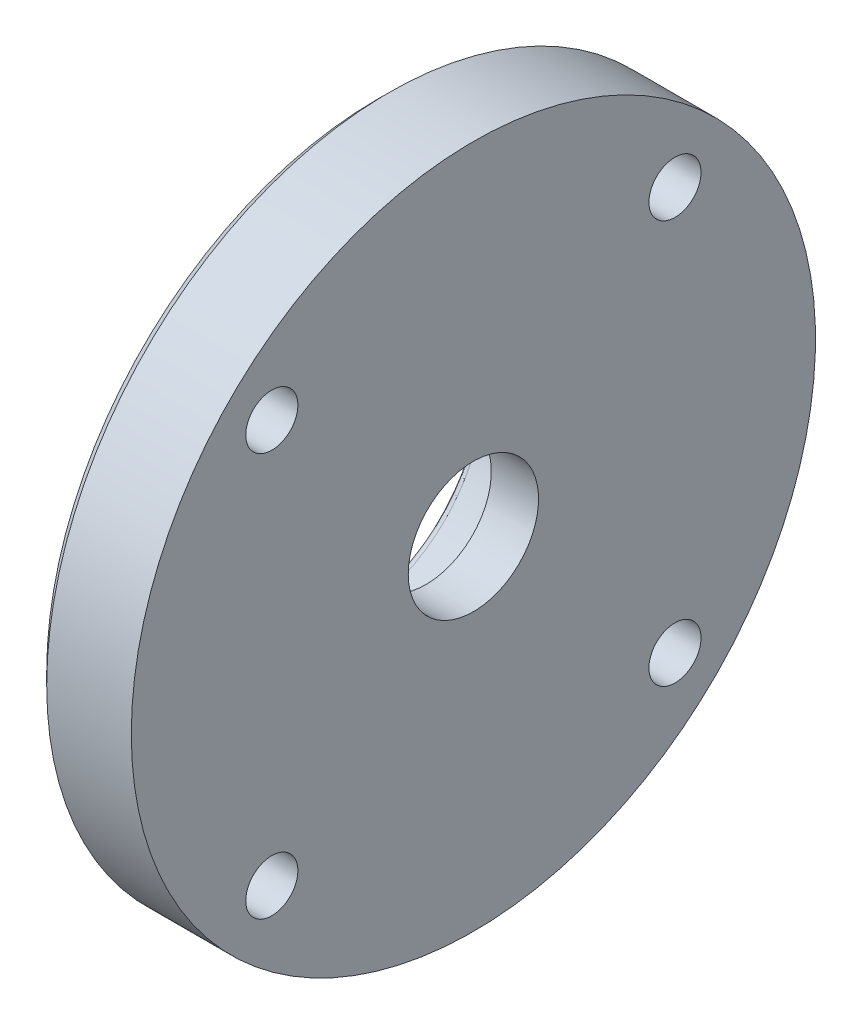
ISO-10303-21;
HEADER;
FILE_DESCRIPTION(('STEP AP214'),'2;1');
FILE_NAME('part.step','',(''),(''),'','','');
FILE_SCHEMA(('AUTOMOTIVE_DESIGN { 1 0 10303 214 1 1 1 1 }'));
ENDSEC;
DATA;
#1=APPLICATION_CONTEXT('core data for automotive mechanical design processes');
#2=APPLICATION_PROTOCOL_DEFINITION('international standard','automotive_design',2000,#1);
#3=PRODUCT_CONTEXT('',#1,'mechanical');
#4=PRODUCT('Part','Part','',(#3));
#5=PRODUCT_RELATED_PRODUCT_CATEGORY('part','',(#4));
#6=PRODUCT_DEFINITION_FORMATION('','',#4);
#7=PRODUCT_DEFINITION_CONTEXT('part definition',#1,'design');
#8=PRODUCT_DEFINITION('design','',#6,#7);
#9=PRODUCT_DEFINITION_SHAPE('','',#8);
#10=(LENGTH_UNIT() NAMED_UNIT(*) SI_UNIT(.MILLI.,.METRE.));
#11=(NAMED_UNIT(*) PLANE_ANGLE_UNIT() SI_UNIT($,.RADIAN.));
#12=(NAMED_UNIT(*) SI_UNIT($,.STERADIAN.) SOLID_ANGLE_UNIT());
#13=UNCERTAINTY_MEASURE_WITH_UNIT(LENGTH_MEASURE(1.E-05),#10,'distance_accuracy_value','');
#14=(GEOMETRIC_REPRESENTATION_CONTEXT(3) GLOBAL_UNCERTAINTY_ASSIGNED_CONTEXT((#13)) GLOBAL_UNIT_ASSIGNED_CONTEXT((#10,
#11,#12)) REPRESENTATION_CONTEXT('',''));
#15=CARTESIAN_POINT('',(0.,0.,0.));
#16=DIRECTION('',(0.,0.,1.));
#17=DIRECTION('',(1.,0.,0.));
#18=AXIS2_PLACEMENT_3D('',#15,#16,#17);
#19=CARTESIAN_POINT('',(10.,0.,0.));
#20=DIRECTION('',(-1.,0.,0.));
#21=DIRECTION('',(0.,0.,1.));
#22=AXIS2_PLACEMENT_3D('',#19,#20,#21);
#23=CYLINDRICAL_SURFACE('',#22,4.);
#24=CARTESIAN_POINT('',(5.9,0.,0.));
#25=DIRECTION('',(-1.,0.,0.));
#26=DIRECTION('',(0.,0.,1.));
#27=AXIS2_PLACEMENT_3D('',#24,#25,#26);
#28=CIRCLE('',#27,4.);
#29=CARTESIAN_POINT('',(5.9,0.,4.));
#30=VERTEX_POINT('',#29);
#31=EDGE_CURVE('E238',#30,#30,#28,.T.);
#32=ORIENTED_EDGE('',*,*,#31,.F.);
#33=EDGE_LOOP('',(#32));
#34=FACE_BOUND('',#33,.T.);
#35=CARTESIAN_POINT('',(3.,0.,0.));
#36=DIRECTION('',(-1.,0.,0.));
#37=DIRECTION('',(0.,0.,1.));
#38=AXIS2_PLACEMENT_3D('',#35,#36,#37);
#39=CIRCLE('',#38,4.);
#40=CARTESIAN_POINT('',(3.,0.,4.));
#41=VERTEX_POINT('',#40);
#42=EDGE_CURVE('E38',#41,#41,#39,.F.);
#43=ORIENTED_EDGE('',*,*,#42,.F.);
#44=EDGE_LOOP('',(#43));
#45=FACE_BOUND('',#44,.T.);
#46=ADVANCED_FACE('F34',(#34,#45),#23,.F.);
#47=CARTESIAN_POINT('',(0.,0.,0.));
#48=DIRECTION('',(1.,0.,0.));
#49=DIRECTION('',(0.,0.,-1.));
#50=AXIS2_PLACEMENT_3D('',#47,#48,#49);
#51=PLANE('',#50);
#52=CARTESIAN_POINT('',(0.,-12.3743686707646,12.3743686707656));
#53=DIRECTION('',(-1.,0.,0.));
#54=DIRECTION('',(0.,0.,1.));
#55=AXIS2_PLACEMENT_3D('',#52,#53,#54);
#56=CIRCLE('',#55,1.59999999999961);
#57=CARTESIAN_POINT('',(0.,-12.3743686707646,13.9743686707652));
#58=VERTEX_POINT('',#57);
#59=EDGE_CURVE('E232',#58,#58,#56,.T.);
#60=ORIENTED_EDGE('',*,*,#59,.F.);
#61=EDGE_LOOP('',(#60));
#62=FACE_BOUND('',#61,.T.);
#63=CARTESIAN_POINT('',(0.,-12.3743686707656,-12.3743686707635));
#64=DIRECTION('',(-1.,0.,0.));
#65=DIRECTION('',(0.,0.,1.));
#66=AXIS2_PLACEMENT_3D('',#63,#64,#65);
#67=CIRCLE('',#66,1.60000000000063);
#68=CARTESIAN_POINT('',(0.,-12.3743686707656,-10.7743686707629));
#69=VERTEX_POINT('',#68);
#70=EDGE_CURVE('E229',#69,#69,#67,.T.);
#71=ORIENTED_EDGE('',*,*,#70,.F.);
#72=EDGE_LOOP('',(#71));
#73=FACE_BOUND('',#72,.T.);
#74=CARTESIAN_POINT('',(0.,12.3743686707635,-12.3743686707646));
#75=DIRECTION('',(-1.,0.,0.));
#76=DIRECTION('',(0.,0.,1.));
#77=AXIS2_PLACEMENT_3D('',#74,#75,#76);
#78=CIRCLE('',#77,1.60000000000097);
#79=CARTESIAN_POINT('',(0.,12.3743686707635,-10.7743686707636));
#80=VERTEX_POINT('',#79);
#81=EDGE_CURVE('E226',#80,#80,#78,.T.);
#82=ORIENTED_EDGE('',*,*,#81,.F.);
#83=EDGE_LOOP('',(#82));
#84=FACE_BOUND('',#83,.T.);
#85=CARTESIAN_POINT('',(0.,12.3743686707646,12.3743686707646));
#86=DIRECTION('',(-1.,0.,0.));
#87=DIRECTION('',(0.,0.,1.));
#88=AXIS2_PLACEMENT_3D('',#85,#86,#87);
#89=CIRCLE('',#88,1.6);
#90=CARTESIAN_POINT('',(0.,12.3743686707646,13.9743686707646));
#91=VERTEX_POINT('',#90);
#92=EDGE_CURVE('E222',#91,#91,#89,.T.);
#93=ORIENTED_EDGE('',*,*,#92,.F.);
#94=EDGE_LOOP('',(#93));
#95=FACE_BOUND('',#94,.T.);
#96=CARTESIAN_POINT('',(0.,-4.79583152331272,11.));
#97=DIRECTION('',(1.,0.,0.));
#98=DIRECTION('',(0.,0.,-1.));
#99=AXIS2_PLACEMENT_3D('',#96,#97,#98);
#100=CIRCLE('',#99,1.);
#101=CARTESIAN_POINT('',(0.,-5.19548415025544,11.9166666666667));
#102=VERTEX_POINT('',#101);
#103=CARTESIAN_POINT('',(0.,-4.79583152331272,12.));
#104=VERTEX_POINT('',#103);
#105=EDGE_CURVE('E272',#102,#104,#100,.F.);
#106=ORIENTED_EDGE('',*,*,#105,.F.);
#107=CARTESIAN_POINT('',(0.,0.,0.));
#108=DIRECTION('',(1.,0.,0.));
#109=DIRECTION('',(0.,0.,-1.));
#110=AXIS2_PLACEMENT_3D('',#107,#108,#109);
#111=CIRCLE('',#110,13.);
#112=CARTESIAN_POINT('',(0.,-5.19548415025545,-11.9166666666667));
#113=VERTEX_POINT('',#112);
#114=EDGE_CURVE('E278',#102,#113,#111,.T.);
#115=ORIENTED_EDGE('',*,*,#114,.T.);
#116=CARTESIAN_POINT('',(0.,-4.79583152331272,-11.));
#117=DIRECTION('',(1.,0.,0.));
#118=DIRECTION('',(0.,0.,-1.));
#119=AXIS2_PLACEMENT_3D('',#116,#117,#118);
#120=CIRCLE('',#119,1.);
#121=CARTESIAN_POINT('',(0.,-4.79583152331272,-12.));
#122=VERTEX_POINT('',#121);
#123=EDGE_CURVE('E275',#122,#113,#120,.F.);
#124=ORIENTED_EDGE('',*,*,#123,.F.);
#125=DIRECTION('',(0.,-1.,0.));
#126=VECTOR('',#125,1.);
#127=CARTESIAN_POINT('',(0.,4.89897948556635,-12.));
#128=LINE('',#127,#126);
#129=CARTESIAN_POINT('',(0.,4.79583152331272,-12.));
#130=VERTEX_POINT('',#129);
#131=EDGE_CURVE('E269',#122,#130,#128,.F.);
#132=ORIENTED_EDGE('',*,*,#131,.T.);
#133=CARTESIAN_POINT('',(0.,4.79583152331272,-11.));
#134=DIRECTION('',(1.,0.,0.));
#135=DIRECTION('',(0.,0.,-1.));
#136=AXIS2_PLACEMENT_3D('',#133,#134,#135);
#137=CIRCLE('',#136,1.);
#138=CARTESIAN_POINT('',(0.,5.19548415025545,-11.9166666666667));
#139=VERTEX_POINT('',#138);
#140=EDGE_CURVE('E266',#139,#130,#137,.F.);
#141=ORIENTED_EDGE('',*,*,#140,.F.);
#142=CARTESIAN_POINT('',(0.,0.,0.));
#143=DIRECTION('',(1.,0.,0.));
#144=DIRECTION('',(0.,0.,-1.));
#145=AXIS2_PLACEMENT_3D('',#142,#143,#144);
#146=CIRCLE('',#145,13.);
#147=CARTESIAN_POINT('',(0.,5.19548415025545,11.9166666666667));
#148=VERTEX_POINT('',#147);
#149=EDGE_CURVE('E262',#139,#148,#146,.T.);
#150=ORIENTED_EDGE('',*,*,#149,.T.);
#151=CARTESIAN_POINT('',(0.,4.79583152331272,11.));
#152=DIRECTION('',(1.,0.,0.));
#153=DIRECTION('',(0.,0.,-1.));
#154=AXIS2_PLACEMENT_3D('',#151,#152,#153);
#155=CIRCLE('',#154,1.);
#156=CARTESIAN_POINT('',(0.,4.79583152331272,12.));
#157=VERTEX_POINT('',#156);
#158=EDGE_CURVE('E259',#157,#148,#155,.F.);
#159=ORIENTED_EDGE('',*,*,#158,.F.);
#160=DIRECTION('',(0.,1.,0.));
#161=VECTOR('',#160,1.);
#162=CARTESIAN_POINT('',(0.,-4.89897948556635,12.));
#163=LINE('',#162,#161);
#164=EDGE_CURVE('E264',#157,#104,#163,.F.);
#165=ORIENTED_EDGE('',*,*,#164,.T.);
#166=EDGE_LOOP('',(#106,#115,#124,#132,#141,#150,#159,#165));
#167=FACE_BOUND('',#166,.T.);
#168=CARTESIAN_POINT('',(0.,0.,0.));
#169=DIRECTION('',(-1.,0.,0.));
#170=DIRECTION('',(0.,0.,1.));
#171=AXIS2_PLACEMENT_3D('',#168,#169,#170);
#172=CIRCLE('',#171,20.2928932188135);
#173=CARTESIAN_POINT('',(0.,0.,20.2928932188135));
#174=VERTEX_POINT('',#173);
#175=EDGE_CURVE('E157',#174,#174,#172,.T.);
#176=ORIENTED_EDGE('',*,*,#175,.T.);
#177=EDGE_LOOP('',(#176));
#178=FACE_BOUND('',#177,.T.);
#179=ADVANCED_FACE('F334',(#62,#73,#84,#95,#167,#178),#51,.F.);
#180=CARTESIAN_POINT('',(0.707106781186548,0.,0.));
#181=DIRECTION('',(1.,0.,0.));
#182=DIRECTION('',(0.,0.,-1.));
#183=AXIS2_PLACEMENT_3D('',#180,#181,#182);
#184=CONICAL_SURFACE('',#183,21.,0.785398163397446);
#185=ORIENTED_EDGE('',*,*,#175,.F.);
#186=EDGE_LOOP('',(#185));
#187=FACE_BOUND('',#186,.T.);
#188=CARTESIAN_POINT('',(0.707106781186548,0.,0.));
#189=DIRECTION('',(-1.,0.,0.));
#190=DIRECTION('',(0.,0.,1.));
#191=AXIS2_PLACEMENT_3D('',#188,#189,#190);
#192=CIRCLE('',#191,21.);
#193=CARTESIAN_POINT('',(0.707106781186548,0.,21.));
#194=VERTEX_POINT('',#193);
#195=EDGE_CURVE('E252',#194,#194,#192,.T.);
#196=ORIENTED_EDGE('',*,*,#195,.T.);
#197=EDGE_LOOP('',(#196));
#198=FACE_BOUND('',#197,.T.);
#199=ADVANCED_FACE('F376',(#187,#198),#184,.T.);
#200=CARTESIAN_POINT('',(0.,0.,0.));
#201=DIRECTION('',(-1.,0.,0.));
#202=DIRECTION('',(0.,0.,1.));
#203=AXIS2_PLACEMENT_3D('',#200,#201,#202);
#204=CYLINDRICAL_SURFACE('',#203,21.);
#205=ORIENTED_EDGE('',*,*,#195,.F.);
#206=EDGE_LOOP('',(#205));
#207=FACE_BOUND('',#206,.T.);
#208=CARTESIAN_POINT('',(5.9,0.,0.));
#209=DIRECTION('',(-1.,0.,0.));
#210=DIRECTION('',(0.,0.,1.));
#211=AXIS2_PLACEMENT_3D('',#208,#209,#210);
#212=CIRCLE('',#211,21.);
#213=CARTESIAN_POINT('',(5.9,0.,21.));
#214=VERTEX_POINT('',#213);
#215=EDGE_CURVE('E217',#214,#214,#212,.T.);
#216=ORIENTED_EDGE('',*,*,#215,.T.);
#217=EDGE_LOOP('',(#216));
#218=FACE_BOUND('',#217,.T.);
#219=ADVANCED_FACE('F423',(#207,#218),#204,.T.);
#220=CARTESIAN_POINT('',(5.9,21.,0.));
#221=DIRECTION('',(-1.,0.,0.));
#222=DIRECTION('',(0.,0.,1.));
#223=AXIS2_PLACEMENT_3D('',#220,#221,#222);
#224=PLANE('',#223);
#225=ORIENTED_EDGE('',*,*,#31,.T.);
#226=EDGE_LOOP('',(#225));
#227=FACE_BOUND('',#226,.T.);
#228=CARTESIAN_POINT('',(5.9,-12.3743686707646,12.3743686707656));
#229=DIRECTION('',(-1.,0.,0.));
#230=DIRECTION('',(0.,0.,1.));
#231=AXIS2_PLACEMENT_3D('',#228,#229,#230);
#232=CIRCLE('',#231,1.59999999999961);
#233=CARTESIAN_POINT('',(5.9,-12.3743686707646,13.9743686707652));
#234=VERTEX_POINT('',#233);
#235=EDGE_CURVE('E230',#234,#234,#232,.T.);
#236=ORIENTED_EDGE('',*,*,#235,.T.);
#237=EDGE_LOOP('',(#236));
#238=FACE_BOUND('',#237,.T.);
#239=CARTESIAN_POINT('',(5.9,-12.3743686707656,-12.3743686707635));
#240=DIRECTION('',(-1.,0.,0.));
#241=DIRECTION('',(0.,0.,1.));
#242=AXIS2_PLACEMENT_3D('',#239,#240,#241);
#243=CIRCLE('',#242,1.60000000000063);
#244=CARTESIAN_POINT('',(5.9,-12.3743686707656,-10.7743686707629));
#245=VERTEX_POINT('',#244);
#246=EDGE_CURVE('E227',#245,#245,#243,.T.);
#247=ORIENTED_EDGE('',*,*,#246,.T.);
#248=EDGE_LOOP('',(#247));
#249=FACE_BOUND('',#248,.T.);
#250=CARTESIAN_POINT('',(5.9,12.3743686707635,-12.3743686707646));
#251=DIRECTION('',(-1.,0.,0.));
#252=DIRECTION('',(0.,0.,1.));
#253=AXIS2_PLACEMENT_3D('',#250,#251,#252);
#254=CIRCLE('',#253,1.60000000000097);
#255=CARTESIAN_POINT('',(5.9,12.3743686707635,-10.7743686707636));
#256=VERTEX_POINT('',#255);
#257=EDGE_CURVE('E223',#256,#256,#254,.T.);
#258=ORIENTED_EDGE('',*,*,#257,.T.);
#259=EDGE_LOOP('',(#258));
#260=FACE_BOUND('',#259,.T.);
#261=CARTESIAN_POINT('',(5.9,12.3743686707646,12.3743686707646));
#262=DIRECTION('',(-1.,0.,0.));
#263=DIRECTION('',(0.,0.,1.));
#264=AXIS2_PLACEMENT_3D('',#261,#262,#263);
#265=CIRCLE('',#264,1.6);
#266=CARTESIAN_POINT('',(5.9,12.3743686707646,13.9743686707646));
#267=VERTEX_POINT('',#266);
#268=EDGE_CURVE('E218',#267,#267,#265,.T.);
#269=ORIENTED_EDGE('',*,*,#268,.T.);
#270=EDGE_LOOP('',(#269));
#271=FACE_BOUND('',#270,.T.);
#272=ORIENTED_EDGE('',*,*,#215,.F.);
#273=EDGE_LOOP('',(#272));
#274=FACE_BOUND('',#273,.T.);
#275=ADVANCED_FACE('F407',(#227,#238,#249,#260,#271,#274),#224,.F.);
#276=CARTESIAN_POINT('',(-2.,0.,0.));
#277=DIRECTION('',(-1.,0.,0.));
#278=DIRECTION('',(0.,0.,1.));
#279=AXIS2_PLACEMENT_3D('',#276,#277,#278);
#280=PLANE('',#279);
#281=CARTESIAN_POINT('',(-2.,0.,0.));
#282=DIRECTION('',(-1.,0.,0.));
#283=DIRECTION('',(0.,0.,1.));
#284=AXIS2_PLACEMENT_3D('',#281,#282,#283);
#285=CIRCLE('',#284,8.5);
#286=CARTESIAN_POINT('',(-2.,0.,8.5));
#287=VERTEX_POINT('',#286);
#288=EDGE_CURVE('E12',#287,#287,#285,.F.);
#289=ORIENTED_EDGE('',*,*,#288,.T.);
#290=EDGE_LOOP('',(#289));
#291=FACE_BOUND('',#290,.T.);
#292=CARTESIAN_POINT('',(-2.,0.,0.));
#293=DIRECTION('',(-1.,0.,0.));
#294=DIRECTION('',(0.,0.,1.));
#295=AXIS2_PLACEMENT_3D('',#292,#293,#294);
#296=CIRCLE('',#295,12.);
#297=CARTESIAN_POINT('',(-2.,-4.79583152331272,-11.));
#298=VERTEX_POINT('',#297);
#299=CARTESIAN_POINT('',(-2.,-4.79583152331272,11.));
#300=VERTEX_POINT('',#299);
#301=EDGE_CURVE('E51',#298,#300,#296,.T.);
#302=ORIENTED_EDGE('',*,*,#301,.T.);
#303=DIRECTION('',(0.,1.,0.));
#304=VECTOR('',#303,1.);
#305=CARTESIAN_POINT('',(-2.,4.89897948556635,11.));
#306=LINE('',#305,#304);
#307=CARTESIAN_POINT('',(-2.,4.79583152331272,11.));
#308=VERTEX_POINT('',#307);
#309=EDGE_CURVE('E43',#300,#308,#306,.T.);
#310=ORIENTED_EDGE('',*,*,#309,.T.);
#311=CARTESIAN_POINT('',(-2.,0.,0.));
#312=DIRECTION('',(-1.,0.,0.));
#313=DIRECTION('',(0.,0.,1.));
#314=AXIS2_PLACEMENT_3D('',#311,#312,#313);
#315=CIRCLE('',#314,12.);
#316=CARTESIAN_POINT('',(-2.,4.79583152331272,-11.));
#317=VERTEX_POINT('',#316);
#318=EDGE_CURVE('E308',#308,#317,#315,.T.);
#319=ORIENTED_EDGE('',*,*,#318,.T.);
#320=DIRECTION('',(0.,-1.,0.));
#321=VECTOR('',#320,1.);
#322=CARTESIAN_POINT('',(-2.,-4.89897948556635,-11.));
#323=LINE('',#322,#321);
#324=EDGE_CURVE('E56',#317,#298,#323,.T.);
#325=ORIENTED_EDGE('',*,*,#324,.T.);
#326=EDGE_LOOP('',(#302,#310,#319,#325));
#327=FACE_BOUND('',#326,.T.);
#328=ADVANCED_FACE('F403',(#291,#327),#280,.T.);
#329=CARTESIAN_POINT('',(-2.,0.,0.));
#330=DIRECTION('',(1.,0.,0.));
#331=DIRECTION('',(0.,0.,-1.));
#332=AXIS2_PLACEMENT_3D('',#329,#330,#331);
#333=CYLINDRICAL_SURFACE('',#332,12.5);
#334=DIRECTION('',(1.,0.,0.));
#335=VECTOR('',#334,1.);
#336=CARTESIAN_POINT('',(-2.,4.99565783678408,11.4583333333333));
#337=LINE('',#336,#335);
#338=CARTESIAN_POINT('',(-1.5,4.99565783678408,11.4583333333333));
#339=VERTEX_POINT('',#338);
#340=CARTESIAN_POINT('',(-0.5,4.99565783678408,11.4583333333333));
#341=VERTEX_POINT('',#340);
#342=EDGE_CURVE('E300',#339,#341,#337,.T.);
#343=ORIENTED_EDGE('',*,*,#342,.T.);
#344=CARTESIAN_POINT('',(-0.5,0.,0.));
#345=DIRECTION('',(1.,0.,0.));
#346=DIRECTION('',(0.,0.,-1.));
#347=AXIS2_PLACEMENT_3D('',#344,#345,#346);
#348=CIRCLE('',#347,12.5);
#349=CARTESIAN_POINT('',(-0.5,4.99565783678408,-11.4583333333333));
#350=VERTEX_POINT('',#349);
#351=EDGE_CURVE('E303',#341,#350,#348,.F.);
#352=ORIENTED_EDGE('',*,*,#351,.T.);
#353=DIRECTION('',(1.,0.,0.));
#354=VECTOR('',#353,1.);
#355=CARTESIAN_POINT('',(-2.,4.99565783678408,-11.4583333333333));
#356=LINE('',#355,#354);
#357=CARTESIAN_POINT('',(-1.5,4.99565783678408,-11.4583333333333));
#358=VERTEX_POINT('',#357);
#359=EDGE_CURVE('E298',#350,#358,#356,.F.);
#360=ORIENTED_EDGE('',*,*,#359,.T.);
#361=CARTESIAN_POINT('',(-1.5,0.,0.));
#362=DIRECTION('',(-1.,0.,0.));
#363=DIRECTION('',(0.,0.,1.));
#364=AXIS2_PLACEMENT_3D('',#361,#362,#363);
#365=CIRCLE('',#364,12.5);
#366=EDGE_CURVE('E296',#358,#339,#365,.F.);
#367=ORIENTED_EDGE('',*,*,#366,.T.);
#368=EDGE_LOOP('',(#343,#352,#360,#367));
#369=FACE_BOUND('',#368,.T.);
#370=ADVANCED_FACE('F406',(#369),#333,.T.);
#371=CARTESIAN_POINT('',(-2.,-4.89897948556635,-11.5));
#372=DIRECTION('',(0.,0.,1.));
#373=DIRECTION('',(1.,0.,0.));
#374=AXIS2_PLACEMENT_3D('',#371,#372,#373);
#375=PLANE('',#374);
#376=DIRECTION('',(1.,0.,0.));
#377=VECTOR('',#376,1.);
#378=CARTESIAN_POINT('',(-2.,4.79583152331272,-11.5));
#379=LINE('',#378,#377);
#380=CARTESIAN_POINT('',(-1.5,4.79583152331272,-11.5));
#381=VERTEX_POINT('',#380);
#382=CARTESIAN_POINT('',(-0.5,4.79583152331272,-11.5));
#383=VERTEX_POINT('',#382);
#384=EDGE_CURVE('E146',#381,#383,#379,.T.);
#385=ORIENTED_EDGE('',*,*,#384,.T.);
#386=DIRECTION('',(0.,-1.,0.));
#387=VECTOR('',#386,1.);
#388=CARTESIAN_POINT('',(-0.5,-4.89897948556635,-11.5));
#389=LINE('',#388,#387);
#390=CARTESIAN_POINT('',(-0.5,-4.79583152331272,-11.5));
#391=VERTEX_POINT('',#390);
#392=EDGE_CURVE('E142',#383,#391,#389,.T.);
#393=ORIENTED_EDGE('',*,*,#392,.T.);
#394=DIRECTION('',(1.,0.,0.));
#395=VECTOR('',#394,1.);
#396=CARTESIAN_POINT('',(-2.,-4.79583152331272,-11.5));
#397=LINE('',#396,#395);
#398=CARTESIAN_POINT('',(-1.5,-4.79583152331272,-11.5));
#399=VERTEX_POINT('',#398);
#400=EDGE_CURVE('E136',#391,#399,#397,.F.);
#401=ORIENTED_EDGE('',*,*,#400,.T.);
#402=DIRECTION('',(0.,-1.,0.));
#403=VECTOR('',#402,1.);
#404=CARTESIAN_POINT('',(-1.5,4.89897948556635,-11.5));
#405=LINE('',#404,#403);
#406=EDGE_CURVE('E139',#399,#381,#405,.F.);
#407=ORIENTED_EDGE('',*,*,#406,.T.);
#408=EDGE_LOOP('',(#385,#393,#401,#407));
#409=FACE_BOUND('',#408,.T.);
#410=ADVANCED_FACE('F138',(#409),#375,.F.);
#411=CARTESIAN_POINT('',(-2.,0.,0.));
#412=DIRECTION('',(1.,0.,0.));
#413=DIRECTION('',(0.,0.,-1.));
#414=AXIS2_PLACEMENT_3D('',#411,#412,#413);
#415=CYLINDRICAL_SURFACE('',#414,12.5);
#416=CARTESIAN_POINT('',(-1.5,0.,0.));
#417=DIRECTION('',(-1.,0.,0.));
#418=DIRECTION('',(0.,0.,1.));
#419=AXIS2_PLACEMENT_3D('',#416,#417,#418);
#420=CIRCLE('',#419,12.5);
#421=CARTESIAN_POINT('',(-1.5,-4.99565783678408,11.4583333333333));
#422=VERTEX_POINT('',#421);
#423=CARTESIAN_POINT('',(-1.5,-4.99565783678408,-11.4583333333333));
#424=VERTEX_POINT('',#423);
#425=EDGE_CURVE('E280',#422,#424,#420,.F.);
#426=ORIENTED_EDGE('',*,*,#425,.T.);
#427=DIRECTION('',(1.,0.,0.));
#428=VECTOR('',#427,1.);
#429=CARTESIAN_POINT('',(-2.,-4.99565783678408,-11.4583333333333));
#430=LINE('',#429,#428);
#431=CARTESIAN_POINT('',(-0.5,-4.99565783678408,-11.4583333333333));
#432=VERTEX_POINT('',#431);
#433=EDGE_CURVE('E169',#424,#432,#430,.T.);
#434=ORIENTED_EDGE('',*,*,#433,.T.);
#435=CARTESIAN_POINT('',(-0.5,0.,0.));
#436=DIRECTION('',(1.,0.,0.));
#437=DIRECTION('',(0.,0.,-1.));
#438=AXIS2_PLACEMENT_3D('',#435,#436,#437);
#439=CIRCLE('',#438,12.5);
#440=CARTESIAN_POINT('',(-0.5,-4.99565783678408,11.4583333333333));
#441=VERTEX_POINT('',#440);
#442=EDGE_CURVE('E284',#432,#441,#439,.F.);
#443=ORIENTED_EDGE('',*,*,#442,.T.);
#444=DIRECTION('',(1.,0.,0.));
#445=VECTOR('',#444,1.);
#446=CARTESIAN_POINT('',(-2.,-4.99565783678408,11.4583333333333));
#447=LINE('',#446,#445);
#448=EDGE_CURVE('E282',#441,#422,#447,.F.);
#449=ORIENTED_EDGE('',*,*,#448,.T.);
#450=EDGE_LOOP('',(#426,#434,#443,#449));
#451=FACE_BOUND('',#450,.T.);
#452=ADVANCED_FACE('F411',(#451),#415,.T.);
#453=CARTESIAN_POINT('',(-2.,-4.89897948556635,11.5));
#454=DIRECTION('',(0.,0.,-1.));
#455=DIRECTION('',(-1.,0.,0.));
#456=AXIS2_PLACEMENT_3D('',#453,#454,#455);
#457=PLANE('',#456);
#458=DIRECTION('',(0.,1.,0.));
#459=VECTOR('',#458,1.);
#460=CARTESIAN_POINT('',(-1.5,-4.89897948556635,11.5));
#461=LINE('',#460,#459);
#462=CARTESIAN_POINT('',(-1.5,4.79583152331272,11.5));
#463=VERTEX_POINT('',#462);
#464=CARTESIAN_POINT('',(-1.5,-4.79583152331272,11.5));
#465=VERTEX_POINT('',#464);
#466=EDGE_CURVE('E287',#463,#465,#461,.F.);
#467=ORIENTED_EDGE('',*,*,#466,.T.);
#468=DIRECTION('',(1.,0.,0.));
#469=VECTOR('',#468,1.);
#470=CARTESIAN_POINT('',(-2.,-4.79583152331272,11.5));
#471=LINE('',#470,#469);
#472=CARTESIAN_POINT('',(-0.5,-4.79583152331272,11.5));
#473=VERTEX_POINT('',#472);
#474=EDGE_CURVE('E293',#465,#473,#471,.T.);
#475=ORIENTED_EDGE('',*,*,#474,.T.);
#476=DIRECTION('',(0.,1.,0.));
#477=VECTOR('',#476,1.);
#478=CARTESIAN_POINT('',(-0.5,4.89897948556635,11.5));
#479=LINE('',#478,#477);
#480=CARTESIAN_POINT('',(-0.5,4.79583152331272,11.5));
#481=VERTEX_POINT('',#480);
#482=EDGE_CURVE('E291',#473,#481,#479,.T.);
#483=ORIENTED_EDGE('',*,*,#482,.T.);
#484=DIRECTION('',(1.,0.,0.));
#485=VECTOR('',#484,1.);
#486=CARTESIAN_POINT('',(-2.,4.79583152331272,11.5));
#487=LINE('',#486,#485);
#488=EDGE_CURVE('E289',#481,#463,#487,.F.);
#489=ORIENTED_EDGE('',*,*,#488,.T.);
#490=EDGE_LOOP('',(#467,#475,#483,#489));
#491=FACE_BOUND('',#490,.T.);
#492=ADVANCED_FACE('F401',(#491),#457,.F.);
#493=CARTESIAN_POINT('',(-2.,0.,0.));
#494=DIRECTION('',(1.,0.,0.));
#495=DIRECTION('',(0.,0.,-1.));
#496=AXIS2_PLACEMENT_3D('',#493,#494,#495);
#497=CYLINDRICAL_SURFACE('',#496,8.);
#498=CARTESIAN_POINT('',(-1.5,0.,0.));
#499=DIRECTION('',(-1.,0.,0.));
#500=DIRECTION('',(0.,0.,1.));
#501=AXIS2_PLACEMENT_3D('',#498,#499,#500);
#502=CIRCLE('',#501,8.);
#503=CARTESIAN_POINT('',(-1.5,0.,8.));
#504=VERTEX_POINT('',#503);
#505=EDGE_CURVE('E305',#504,#504,#502,.T.);
#506=ORIENTED_EDGE('',*,*,#505,.T.);
#507=EDGE_LOOP('',(#506));
#508=FACE_BOUND('',#507,.T.);
#509=CARTESIAN_POINT('',(3.,0.,0.));
#510=DIRECTION('',(-1.,0.,0.));
#511=DIRECTION('',(0.,0.,1.));
#512=AXIS2_PLACEMENT_3D('',#509,#510,#511);
#513=CIRCLE('',#512,8.);
#514=CARTESIAN_POINT('',(3.,0.,8.));
#515=VERTEX_POINT('',#514);
#516=EDGE_CURVE('E708',#515,#515,#513,.F.);
#517=ORIENTED_EDGE('',*,*,#516,.T.);
#518=EDGE_LOOP('',(#517));
#519=FACE_BOUND('',#518,.T.);
#520=ADVANCED_FACE('F397',(#508,#519),#497,.F.);
#521=CARTESIAN_POINT('',(-1.5,0.,11.));
#522=DIRECTION('',(0.,-1.,0.));
#523=DIRECTION('',(0.,0.,-1.));
#524=AXIS2_PLACEMENT_3D('',#521,#522,#523);
#525=CYLINDRICAL_SURFACE('',#524,0.5);
#526=CARTESIAN_POINT('',(-1.5,4.79583152331272,11.));
#527=DIRECTION('',(0.,1.,0.));
#528=DIRECTION('',(0.,0.,1.));
#529=AXIS2_PLACEMENT_3D('',#526,#527,#528);
#530=CIRCLE('',#529,0.5);
#531=EDGE_CURVE('E214',#308,#463,#530,.T.);
#532=ORIENTED_EDGE('',*,*,#531,.F.);
#533=ORIENTED_EDGE('',*,*,#309,.F.);
#534=CARTESIAN_POINT('',(-1.5,-4.79583152331272,11.));
#535=DIRECTION('',(0.,-1.,0.));
#536=DIRECTION('',(1.,0.,0.));
#537=AXIS2_PLACEMENT_3D('',#534,#535,#536);
#538=CIRCLE('',#537,0.5);
#539=EDGE_CURVE('E211',#465,#300,#538,.T.);
#540=ORIENTED_EDGE('',*,*,#539,.F.);
#541=ORIENTED_EDGE('',*,*,#466,.F.);
#542=EDGE_LOOP('',(#532,#533,#540,#541));
#543=FACE_BOUND('',#542,.T.);
#544=ADVANCED_FACE('F400',(#543),#525,.T.);
#545=CARTESIAN_POINT('',(-1.5,4.79583152331271,11.));
#546=DIRECTION('',(0.,0.,1.));
#547=DIRECTION('',(1.,0.,0.));
#548=AXIS2_PLACEMENT_3D('',#545,#546,#547);
#549=SPHERICAL_SURFACE('',#548,0.5);
#550=CARTESIAN_POINT('',(-1.5,4.79583152331272,11.));
#551=DIRECTION('',(0.,-0.916666666666666,0.399652626942727));
#552=DIRECTION('',(0.,-0.399652626942727,-0.916666666666667));
#553=AXIS2_PLACEMENT_3D('',#550,#551,#552);
#554=CIRCLE('',#553,0.5);
#555=EDGE_CURVE('E205',#308,#339,#554,.F.);
#556=ORIENTED_EDGE('',*,*,#555,.F.);
#557=ORIENTED_EDGE('',*,*,#531,.T.);
#558=CARTESIAN_POINT('',(-1.5,4.79583152331272,11.));
#559=DIRECTION('',(-1.,0.,0.));
#560=DIRECTION('',(0.,0.,1.));
#561=AXIS2_PLACEMENT_3D('',#558,#559,#560);
#562=CIRCLE('',#561,0.5);
#563=EDGE_CURVE('E208',#339,#463,#562,.F.);
#564=ORIENTED_EDGE('',*,*,#563,.F.);
#565=EDGE_LOOP('',(#556,#557,#564));
#566=FACE_BOUND('',#565,.T.);
#567=ADVANCED_FACE('F480',(#566),#549,.T.);
#568=CARTESIAN_POINT('',(-1.5,-4.79583152331272,11.));
#569=DIRECTION('',(0.,0.,1.));
#570=DIRECTION('',(1.,0.,0.));
#571=AXIS2_PLACEMENT_3D('',#568,#569,#570);
#572=SPHERICAL_SURFACE('',#571,0.5);
#573=CARTESIAN_POINT('',(-1.5,-4.79583152331272,11.));
#574=DIRECTION('',(-1.,0.,0.));
#575=DIRECTION('',(0.,0.,1.));
#576=AXIS2_PLACEMENT_3D('',#573,#574,#575);
#577=CIRCLE('',#576,0.5);
#578=EDGE_CURVE('E199',#465,#422,#577,.F.);
#579=ORIENTED_EDGE('',*,*,#578,.F.);
#580=ORIENTED_EDGE('',*,*,#539,.T.);
#581=CARTESIAN_POINT('',(-1.5,-4.79583152331272,11.));
#582=DIRECTION('',(0.,0.916666666666668,0.399652626942725));
#583=DIRECTION('',(0.,-0.399652626942725,0.916666666666668));
#584=AXIS2_PLACEMENT_3D('',#581,#582,#583);
#585=CIRCLE('',#584,0.5);
#586=EDGE_CURVE('E202',#422,#300,#585,.F.);
#587=ORIENTED_EDGE('',*,*,#586,.F.);
#588=EDGE_LOOP('',(#579,#580,#587));
#589=FACE_BOUND('',#588,.T.);
#590=ADVANCED_FACE('F487',(#589),#572,.T.);
#591=CARTESIAN_POINT('',(-2.,4.79583152331272,11.));
#592=DIRECTION('',(1.,0.,0.));
#593=DIRECTION('',(0.,0.,-1.));
#594=AXIS2_PLACEMENT_3D('',#591,#592,#593);
#595=CYLINDRICAL_SURFACE('',#594,0.5);
#596=ORIENTED_EDGE('',*,*,#563,.T.);
#597=ORIENTED_EDGE('',*,*,#488,.F.);
#598=CARTESIAN_POINT('',(-0.5,4.79583152331272,11.));
#599=DIRECTION('',(1.,0.,0.));
#600=DIRECTION('',(0.,0.,-1.));
#601=AXIS2_PLACEMENT_3D('',#598,#599,#600);
#602=CIRCLE('',#601,0.5);
#603=EDGE_CURVE('E193',#341,#481,#602,.T.);
#604=ORIENTED_EDGE('',*,*,#603,.F.);
#605=ORIENTED_EDGE('',*,*,#342,.F.);
#606=EDGE_LOOP('',(#596,#597,#604,#605));
#607=FACE_BOUND('',#606,.T.);
#608=ADVANCED_FACE('F495',(#607),#595,.T.);
#609=CARTESIAN_POINT('',(-1.5,0.,0.));
#610=DIRECTION('',(-1.,0.,0.));
#611=DIRECTION('',(0.,0.,1.));
#612=AXIS2_PLACEMENT_3D('',#609,#610,#611);
#613=TOROIDAL_SURFACE('',#612,12.,0.5);
#614=ORIENTED_EDGE('',*,*,#555,.T.);
#615=ORIENTED_EDGE('',*,*,#366,.F.);
#616=CARTESIAN_POINT('',(-1.5,4.79583152331272,-11.));
#617=DIRECTION('',(0.,-0.916666666666668,-0.399652626942725));
#618=DIRECTION('',(0.,0.399652626942725,-0.916666666666668));
#619=AXIS2_PLACEMENT_3D('',#616,#617,#618);
#620=CIRCLE('',#619,0.5);
#621=EDGE_CURVE('E190',#317,#358,#620,.T.);
#622=ORIENTED_EDGE('',*,*,#621,.F.);
#623=ORIENTED_EDGE('',*,*,#318,.F.);
#624=EDGE_LOOP('',(#614,#615,#622,#623));
#625=FACE_BOUND('',#624,.T.);
#626=ADVANCED_FACE('F503',(#625),#613,.T.);
#627=CARTESIAN_POINT('',(-1.5,0.,-11.));
#628=DIRECTION('',(0.,1.,0.));
#629=DIRECTION('',(0.,0.,1.));
#630=AXIS2_PLACEMENT_3D('',#627,#628,#629);
#631=CYLINDRICAL_SURFACE('',#630,0.5);
#632=CARTESIAN_POINT('',(-1.5,-4.79583152331272,-11.));
#633=DIRECTION('',(0.,-1.,0.));
#634=DIRECTION('',(0.,0.,-1.));
#635=AXIS2_PLACEMENT_3D('',#632,#633,#634);
#636=CIRCLE('',#635,0.5);
#637=EDGE_CURVE('E152',#298,#399,#636,.T.);
#638=ORIENTED_EDGE('',*,*,#637,.F.);
#639=ORIENTED_EDGE('',*,*,#324,.F.);
#640=CARTESIAN_POINT('',(-1.5,4.79583152331272,-11.));
#641=DIRECTION('',(0.,1.,0.));
#642=DIRECTION('',(-1.,0.,0.));
#643=AXIS2_PLACEMENT_3D('',#640,#641,#642);
#644=CIRCLE('',#643,0.5);
#645=EDGE_CURVE('E155',#381,#317,#644,.T.);
#646=ORIENTED_EDGE('',*,*,#645,.F.);
#647=ORIENTED_EDGE('',*,*,#406,.F.);
#648=EDGE_LOOP('',(#638,#639,#646,#647));
#649=FACE_BOUND('',#648,.T.);
#650=ADVANCED_FACE('F151',(#649),#631,.T.);
#651=CARTESIAN_POINT('',(-1.5,0.,0.));
#652=DIRECTION('',(-1.,0.,0.));
#653=DIRECTION('',(0.,0.,1.));
#654=AXIS2_PLACEMENT_3D('',#651,#652,#653);
#655=TOROIDAL_SURFACE('',#654,12.,0.5);
#656=ORIENTED_EDGE('',*,*,#586,.T.);
#657=ORIENTED_EDGE('',*,*,#301,.F.);
#658=CARTESIAN_POINT('',(-1.5,-4.79583152331272,-11.));
#659=DIRECTION('',(0.,0.916666666666666,-0.399652626942727));
#660=DIRECTION('',(0.,0.399652626942727,0.916666666666667));
#661=AXIS2_PLACEMENT_3D('',#658,#659,#660);
#662=CIRCLE('',#661,0.5);
#663=EDGE_CURVE('E165',#424,#298,#662,.T.);
#664=ORIENTED_EDGE('',*,*,#663,.F.);
#665=ORIENTED_EDGE('',*,*,#425,.F.);
#666=EDGE_LOOP('',(#656,#657,#664,#665));
#667=FACE_BOUND('',#666,.T.);
#668=ADVANCED_FACE('F518',(#667),#655,.T.);
#669=CARTESIAN_POINT('',(-2.,-4.79583152331272,11.));
#670=DIRECTION('',(1.,0.,0.));
#671=DIRECTION('',(0.,0.,-1.));
#672=AXIS2_PLACEMENT_3D('',#669,#670,#671);
#673=CYLINDRICAL_SURFACE('',#672,0.5);
#674=ORIENTED_EDGE('',*,*,#578,.T.);
#675=ORIENTED_EDGE('',*,*,#448,.F.);
#676=CARTESIAN_POINT('',(-0.5,-4.79583152331272,11.));
#677=DIRECTION('',(1.,0.,0.));
#678=DIRECTION('',(0.,0.,-1.));
#679=AXIS2_PLACEMENT_3D('',#676,#677,#678);
#680=CIRCLE('',#679,0.5);
#681=EDGE_CURVE('E185',#473,#441,#680,.T.);
#682=ORIENTED_EDGE('',*,*,#681,.F.);
#683=ORIENTED_EDGE('',*,*,#474,.F.);
#684=EDGE_LOOP('',(#674,#675,#682,#683));
#685=FACE_BOUND('',#684,.T.);
#686=ADVANCED_FACE('F525',(#685),#673,.T.);
#687=CARTESIAN_POINT('',(-0.5,-4.89897948556635,12.));
#688=DIRECTION('',(0.,-1.,0.));
#689=DIRECTION('',(0.,0.,-1.));
#690=AXIS2_PLACEMENT_3D('',#687,#688,#689);
#691=CYLINDRICAL_SURFACE('',#690,0.5);
#692=CARTESIAN_POINT('',(-0.5,-4.79583152331272,12.));
#693=DIRECTION('',(0.,1.,0.));
#694=DIRECTION('',(0.,0.,1.));
#695=AXIS2_PLACEMENT_3D('',#692,#693,#694);
#696=CIRCLE('',#695,0.5);
#697=EDGE_CURVE('E183',#104,#473,#696,.T.);
#698=ORIENTED_EDGE('',*,*,#697,.F.);
#699=ORIENTED_EDGE('',*,*,#164,.F.);
#700=CARTESIAN_POINT('',(-0.5,4.79583152331272,12.));
#701=DIRECTION('',(0.,-1.,0.));
#702=DIRECTION('',(0.,0.,-1.));
#703=AXIS2_PLACEMENT_3D('',#700,#701,#702);
#704=CIRCLE('',#703,0.5);
#705=EDGE_CURVE('E196',#481,#157,#704,.T.);
#706=ORIENTED_EDGE('',*,*,#705,.F.);
#707=ORIENTED_EDGE('',*,*,#482,.F.);
#708=EDGE_LOOP('',(#698,#699,#706,#707));
#709=FACE_BOUND('',#708,.T.);
#710=ADVANCED_FACE('F344',(#709),#691,.F.);
#711=CARTESIAN_POINT('',(-0.5,4.79583152331272,11.));
#712=DIRECTION('',(1.,0.,0.));
#713=DIRECTION('',(0.,0.,-1.));
#714=AXIS2_PLACEMENT_3D('',#711,#712,#713);
#715=TOROIDAL_SURFACE('',#714,1.,0.5);
#716=ORIENTED_EDGE('',*,*,#705,.T.);
#717=ORIENTED_EDGE('',*,*,#158,.T.);
#718=CARTESIAN_POINT('',(-0.5,5.19548415025545,11.9166666666667));
#719=DIRECTION('',(0.,0.916666666666666,-0.399652626942727));
#720=DIRECTION('',(0.,0.399652626942727,0.916666666666667));
#721=AXIS2_PLACEMENT_3D('',#718,#719,#720);
#722=CIRCLE('',#721,0.5);
#723=EDGE_CURVE('E174',#341,#148,#722,.F.);
#724=ORIENTED_EDGE('',*,*,#723,.F.);
#725=ORIENTED_EDGE('',*,*,#603,.T.);
#726=EDGE_LOOP('',(#716,#717,#724,#725));
#727=FACE_BOUND('',#726,.T.);
#728=ADVANCED_FACE('F338',(#727),#715,.F.);
#729=CARTESIAN_POINT('',(-1.5,4.79583152331272,-11.));
#730=DIRECTION('',(0.,0.,1.));
#731=DIRECTION('',(1.,0.,0.));
#732=AXIS2_PLACEMENT_3D('',#729,#730,#731);
#733=SPHERICAL_SURFACE('',#732,0.5);
#734=ORIENTED_EDGE('',*,*,#645,.T.);
#735=ORIENTED_EDGE('',*,*,#621,.T.);
#736=CARTESIAN_POINT('',(-1.5,4.79583152331272,-11.));
#737=DIRECTION('',(-1.,0.,0.));
#738=DIRECTION('',(0.,0.,1.));
#739=AXIS2_PLACEMENT_3D('',#736,#737,#738);
#740=CIRCLE('',#739,0.5);
#741=EDGE_CURVE('E170',#381,#358,#740,.F.);
#742=ORIENTED_EDGE('',*,*,#741,.F.);
#743=EDGE_LOOP('',(#734,#735,#742));
#744=FACE_BOUND('',#743,.T.);
#745=ADVANCED_FACE('F546',(#744),#733,.T.);
#746=CARTESIAN_POINT('',(-1.5,-4.79583152331271,-11.));
#747=DIRECTION('',(0.,0.,1.));
#748=DIRECTION('',(1.,0.,0.));
#749=AXIS2_PLACEMENT_3D('',#746,#747,#748);
#750=SPHERICAL_SURFACE('',#749,0.5);
#751=ORIENTED_EDGE('',*,*,#663,.T.);
#752=ORIENTED_EDGE('',*,*,#637,.T.);
#753=CARTESIAN_POINT('',(-1.5,-4.79583152331272,-11.));
#754=DIRECTION('',(-1.,0.,0.));
#755=DIRECTION('',(0.,0.,1.));
#756=AXIS2_PLACEMENT_3D('',#753,#754,#755);
#757=CIRCLE('',#756,0.5);
#758=EDGE_CURVE('E162',#424,#399,#757,.F.);
#759=ORIENTED_EDGE('',*,*,#758,.F.);
#760=EDGE_LOOP('',(#751,#752,#759));
#761=FACE_BOUND('',#760,.T.);
#762=ADVANCED_FACE('F161',(#761),#750,.T.);
#763=CARTESIAN_POINT('',(-0.5,-4.79583152331272,11.));
#764=DIRECTION('',(1.,0.,0.));
#765=DIRECTION('',(0.,0.,-1.));
#766=AXIS2_PLACEMENT_3D('',#763,#764,#765);
#767=TOROIDAL_SURFACE('',#766,1.,0.5);
#768=ORIENTED_EDGE('',*,*,#697,.T.);
#769=ORIENTED_EDGE('',*,*,#681,.T.);
#770=CARTESIAN_POINT('',(-0.5,-5.19548415025544,11.9166666666667));
#771=DIRECTION('',(0.,-0.916666666666666,-0.399652626942727));
#772=DIRECTION('',(0.,0.399652626942727,-0.916666666666667));
#773=AXIS2_PLACEMENT_3D('',#770,#771,#772);
#774=CIRCLE('',#773,0.5);
#775=EDGE_CURVE('E171',#102,#441,#774,.F.);
#776=ORIENTED_EDGE('',*,*,#775,.F.);
#777=ORIENTED_EDGE('',*,*,#105,.T.);
#778=EDGE_LOOP('',(#768,#769,#776,#777));
#779=FACE_BOUND('',#778,.T.);
#780=ADVANCED_FACE('F349',(#779),#767,.F.);
#781=CARTESIAN_POINT('',(-0.5,0.,0.));
#782=DIRECTION('',(1.,0.,0.));
#783=DIRECTION('',(0.,0.,-1.));
#784=AXIS2_PLACEMENT_3D('',#781,#782,#783);
#785=TOROIDAL_SURFACE('',#784,13.,0.5);
#786=ORIENTED_EDGE('',*,*,#723,.T.);
#787=ORIENTED_EDGE('',*,*,#149,.F.);
#788=CARTESIAN_POINT('',(-0.5,5.19548415025545,-11.9166666666667));
#789=DIRECTION('',(0.,0.916666666666666,0.399652626942727));
#790=DIRECTION('',(0.,-0.399652626942727,0.916666666666667));
#791=AXIS2_PLACEMENT_3D('',#788,#789,#790);
#792=CIRCLE('',#791,0.5);
#793=EDGE_CURVE('E177',#350,#139,#792,.T.);
#794=ORIENTED_EDGE('',*,*,#793,.F.);
#795=ORIENTED_EDGE('',*,*,#351,.F.);
#796=EDGE_LOOP('',(#786,#787,#794,#795));
#797=FACE_BOUND('',#796,.T.);
#798=ADVANCED_FACE('F331',(#797),#785,.F.);
#799=CARTESIAN_POINT('',(-2.,4.79583152331272,-11.));
#800=DIRECTION('',(1.,0.,0.));
#801=DIRECTION('',(0.,0.,-1.));
#802=AXIS2_PLACEMENT_3D('',#799,#800,#801);
#803=CYLINDRICAL_SURFACE('',#802,0.5);
#804=ORIENTED_EDGE('',*,*,#741,.T.);
#805=ORIENTED_EDGE('',*,*,#359,.F.);
#806=CARTESIAN_POINT('',(-0.5,4.79583152331272,-11.));
#807=DIRECTION('',(1.,0.,0.));
#808=DIRECTION('',(0.,0.,-1.));
#809=AXIS2_PLACEMENT_3D('',#806,#807,#808);
#810=CIRCLE('',#809,0.5);
#811=EDGE_CURVE('E321',#383,#350,#810,.T.);
#812=ORIENTED_EDGE('',*,*,#811,.F.);
#813=ORIENTED_EDGE('',*,*,#384,.F.);
#814=EDGE_LOOP('',(#804,#805,#812,#813));
#815=FACE_BOUND('',#814,.T.);
#816=ADVANCED_FACE('F572',(#815),#803,.T.);
#817=CARTESIAN_POINT('',(-2.,-4.79583152331272,-11.));
#818=DIRECTION('',(1.,0.,0.));
#819=DIRECTION('',(0.,0.,-1.));
#820=AXIS2_PLACEMENT_3D('',#817,#818,#819);
#821=CYLINDRICAL_SURFACE('',#820,0.5);
#822=ORIENTED_EDGE('',*,*,#758,.T.);
#823=ORIENTED_EDGE('',*,*,#400,.F.);
#824=CARTESIAN_POINT('',(-0.5,-4.79583152331272,-11.));
#825=DIRECTION('',(1.,0.,0.));
#826=DIRECTION('',(0.,0.,-1.));
#827=AXIS2_PLACEMENT_3D('',#824,#825,#826);
#828=CIRCLE('',#827,0.5);
#829=EDGE_CURVE('E318',#432,#391,#828,.T.);
#830=ORIENTED_EDGE('',*,*,#829,.F.);
#831=ORIENTED_EDGE('',*,*,#433,.F.);
#832=EDGE_LOOP('',(#822,#823,#830,#831));
#833=FACE_BOUND('',#832,.T.);
#834=ADVANCED_FACE('F167',(#833),#821,.T.);
#835=CARTESIAN_POINT('',(-0.5,0.,0.));
#836=DIRECTION('',(1.,0.,0.));
#837=DIRECTION('',(0.,0.,-1.));
#838=AXIS2_PLACEMENT_3D('',#835,#836,#837);
#839=TOROIDAL_SURFACE('',#838,13.,0.5);
#840=ORIENTED_EDGE('',*,*,#775,.T.);
#841=ORIENTED_EDGE('',*,*,#442,.F.);
#842=CARTESIAN_POINT('',(-0.5,-5.19548415025545,-11.9166666666667));
#843=DIRECTION('',(0.,-0.916666666666666,0.399652626942727));
#844=DIRECTION('',(0.,-0.399652626942727,-0.916666666666667));
#845=AXIS2_PLACEMENT_3D('',#842,#843,#844);
#846=CIRCLE('',#845,0.5);
#847=EDGE_CURVE('E316',#113,#432,#846,.T.);
#848=ORIENTED_EDGE('',*,*,#847,.F.);
#849=ORIENTED_EDGE('',*,*,#114,.F.);
#850=EDGE_LOOP('',(#840,#841,#848,#849));
#851=FACE_BOUND('',#850,.T.);
#852=ADVANCED_FACE('F353',(#851),#839,.F.);
#853=CARTESIAN_POINT('',(-0.5,4.79583152331272,-11.));
#854=DIRECTION('',(1.,0.,0.));
#855=DIRECTION('',(0.,0.,-1.));
#856=AXIS2_PLACEMENT_3D('',#853,#854,#855);
#857=TOROIDAL_SURFACE('',#856,1.,0.5);
#858=ORIENTED_EDGE('',*,*,#793,.T.);
#859=ORIENTED_EDGE('',*,*,#140,.T.);
#860=CARTESIAN_POINT('',(-0.5,4.79583152331272,-12.));
#861=DIRECTION('',(0.,-1.,0.));
#862=DIRECTION('',(0.,0.,-1.));
#863=AXIS2_PLACEMENT_3D('',#860,#861,#862);
#864=CIRCLE('',#863,0.5);
#865=EDGE_CURVE('E314',#383,#130,#864,.F.);
#866=ORIENTED_EDGE('',*,*,#865,.F.);
#867=ORIENTED_EDGE('',*,*,#811,.T.);
#868=EDGE_LOOP('',(#858,#859,#866,#867));
#869=FACE_BOUND('',#868,.T.);
#870=ADVANCED_FACE('F326',(#869),#857,.F.);
#871=CARTESIAN_POINT('',(-0.5,-4.79583152331272,-11.));
#872=DIRECTION('',(1.,0.,0.));
#873=DIRECTION('',(0.,0.,-1.));
#874=AXIS2_PLACEMENT_3D('',#871,#872,#873);
#875=TOROIDAL_SURFACE('',#874,1.,0.5);
#876=ORIENTED_EDGE('',*,*,#847,.T.);
#877=ORIENTED_EDGE('',*,*,#829,.T.);
#878=CARTESIAN_POINT('',(-0.5,-4.79583152331272,-12.));
#879=DIRECTION('',(0.,1.,0.));
#880=DIRECTION('',(0.,0.,1.));
#881=AXIS2_PLACEMENT_3D('',#878,#879,#880);
#882=CIRCLE('',#881,0.5);
#883=EDGE_CURVE('E221',#122,#391,#882,.F.);
#884=ORIENTED_EDGE('',*,*,#883,.F.);
#885=ORIENTED_EDGE('',*,*,#123,.T.);
#886=EDGE_LOOP('',(#876,#877,#884,#885));
#887=FACE_BOUND('',#886,.T.);
#888=ADVANCED_FACE('F356',(#887),#875,.F.);
#889=CARTESIAN_POINT('',(-0.5,-4.89897948556635,-12.));
#890=DIRECTION('',(0.,1.,0.));
#891=DIRECTION('',(0.,0.,1.));
#892=AXIS2_PLACEMENT_3D('',#889,#890,#891);
#893=CYLINDRICAL_SURFACE('',#892,0.5);
#894=ORIENTED_EDGE('',*,*,#865,.T.);
#895=ORIENTED_EDGE('',*,*,#131,.F.);
#896=ORIENTED_EDGE('',*,*,#883,.T.);
#897=ORIENTED_EDGE('',*,*,#392,.F.);
#898=EDGE_LOOP('',(#894,#895,#896,#897));
#899=FACE_BOUND('',#898,.T.);
#900=ADVANCED_FACE('F359',(#899),#893,.F.);
#901=CARTESIAN_POINT('',(-1.5,0.,0.));
#902=DIRECTION('',(-1.,0.,0.));
#903=DIRECTION('',(0.,0.,1.));
#904=AXIS2_PLACEMENT_3D('',#901,#902,#903);
#905=TOROIDAL_SURFACE('',#904,8.5,0.5);
#906=ORIENTED_EDGE('',*,*,#288,.F.);
#907=EDGE_LOOP('',(#906));
#908=FACE_BOUND('',#907,.T.);
#909=ORIENTED_EDGE('',*,*,#505,.F.);
#910=EDGE_LOOP('',(#909));
#911=FACE_BOUND('',#910,.T.);
#912=ADVANCED_FACE('F36',(#908,#911),#905,.T.);
#913=CARTESIAN_POINT('',(10.,12.3743686707646,12.3743686707646));
#914=DIRECTION('',(-1.,0.,0.));
#915=DIRECTION('',(0.,0.,1.));
#916=AXIS2_PLACEMENT_3D('',#913,#914,#915);
#917=CYLINDRICAL_SURFACE('',#916,1.6);
#918=ORIENTED_EDGE('',*,*,#92,.T.);
#919=EDGE_LOOP('',(#918));
#920=FACE_BOUND('',#919,.T.);
#921=ORIENTED_EDGE('',*,*,#268,.F.);
#922=EDGE_LOOP('',(#921));
#923=FACE_BOUND('',#922,.T.);
#924=ADVANCED_FACE('F366',(#920,#923),#917,.F.);
#925=CARTESIAN_POINT('',(10.,12.3743686707635,-12.3743686707646));
#926=DIRECTION('',(-1.,0.,0.));
#927=DIRECTION('',(0.,0.,1.));
#928=AXIS2_PLACEMENT_3D('',#925,#926,#927);
#929=CYLINDRICAL_SURFACE('',#928,1.60000000000097);
#930=ORIENTED_EDGE('',*,*,#81,.T.);
#931=EDGE_LOOP('',(#930));
#932=FACE_BOUND('',#931,.T.);
#933=ORIENTED_EDGE('',*,*,#257,.F.);
#934=EDGE_LOOP('',(#933));
#935=FACE_BOUND('',#934,.T.);
#936=ADVANCED_FACE('F389',(#932,#935),#929,.F.);
#937=CARTESIAN_POINT('',(10.,-12.3743686707656,-12.3743686707635));
#938=DIRECTION('',(-1.,0.,0.));
#939=DIRECTION('',(0.,0.,1.));
#940=AXIS2_PLACEMENT_3D('',#937,#938,#939);
#941=CYLINDRICAL_SURFACE('',#940,1.60000000000063);
#942=ORIENTED_EDGE('',*,*,#70,.T.);
#943=EDGE_LOOP('',(#942));
#944=FACE_BOUND('',#943,.T.);
#945=ORIENTED_EDGE('',*,*,#246,.F.);
#946=EDGE_LOOP('',(#945));
#947=FACE_BOUND('',#946,.T.);
#948=ADVANCED_FACE('F386',(#944,#947),#941,.F.);
#949=CARTESIAN_POINT('',(10.,-12.3743686707646,12.3743686707656));
#950=DIRECTION('',(-1.,0.,0.));
#951=DIRECTION('',(0.,0.,1.));
#952=AXIS2_PLACEMENT_3D('',#949,#950,#951);
#953=CYLINDRICAL_SURFACE('',#952,1.59999999999961);
#954=ORIENTED_EDGE('',*,*,#59,.T.);
#955=EDGE_LOOP('',(#954));
#956=FACE_BOUND('',#955,.T.);
#957=ORIENTED_EDGE('',*,*,#235,.F.);
#958=EDGE_LOOP('',(#957));
#959=FACE_BOUND('',#958,.T.);
#960=ADVANCED_FACE('F383',(#956,#959),#953,.F.);
#961=CARTESIAN_POINT('',(3.,0.,0.));
#962=DIRECTION('',(-1.,0.,0.));
#963=DIRECTION('',(0.,0.,1.));
#964=AXIS2_PLACEMENT_3D('',#961,#962,#963);
#965=PLANE('',#964);
#966=ORIENTED_EDGE('',*,*,#516,.F.);
#967=EDGE_LOOP('',(#966));
#968=FACE_BOUND('',#967,.T.);
#969=ORIENTED_EDGE('',*,*,#42,.T.);
#970=EDGE_LOOP('',(#969));
#971=FACE_BOUND('',#970,.T.);
#972=ADVANCED_FACE('F382',(#968,#971),#965,.T.);
#973=CLOSED_SHELL('',(#46,#179,#199,#219,#275,#328,#370,#410,#452,#492,#520,#544,#567,#590,#608,
#626,#650,#668,#686,#710,#728,#745,#762,#780,#798,#816,#834,#852,#870,#888,#900,#912,#924,#936,
#948,#960,#972));
#974=MANIFOLD_SOLID_BREP('B2',#973);
#975=ADVANCED_BREP_SHAPE_REPRESENTATION('',(#18,#974),#14);
#976=SHAPE_DEFINITION_REPRESENTATION(#9,#975);
ENDSEC;
END-ISO-10303-21;
